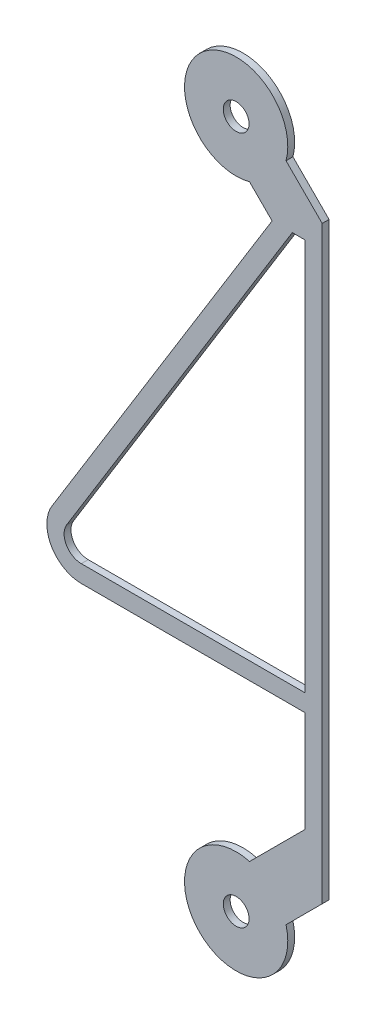
ISO-10303-21;
HEADER;
FILE_DESCRIPTION(('STEP AP214'),'2;1');
FILE_NAME('part.step','',(''),(''),'','','');
FILE_SCHEMA(('AUTOMOTIVE_DESIGN { 1 0 10303 214 1 1 1 1 }'));
ENDSEC;
DATA;
#1=APPLICATION_CONTEXT('core data for automotive mechanical design processes');
#2=APPLICATION_PROTOCOL_DEFINITION('international standard','automotive_design',2000,#1);
#3=PRODUCT_CONTEXT('',#1,'mechanical');
#4=PRODUCT('Part','Part','',(#3));
#5=PRODUCT_RELATED_PRODUCT_CATEGORY('part','',(#4));
#6=PRODUCT_DEFINITION_FORMATION('','',#4);
#7=PRODUCT_DEFINITION_CONTEXT('part definition',#1,'design');
#8=PRODUCT_DEFINITION('design','',#6,#7);
#9=PRODUCT_DEFINITION_SHAPE('','',#8);
#10=(LENGTH_UNIT() NAMED_UNIT(*) SI_UNIT(.MILLI.,.METRE.));
#11=(NAMED_UNIT(*) PLANE_ANGLE_UNIT() SI_UNIT($,.RADIAN.));
#12=(NAMED_UNIT(*) SI_UNIT($,.STERADIAN.) SOLID_ANGLE_UNIT());
#13=UNCERTAINTY_MEASURE_WITH_UNIT(LENGTH_MEASURE(1.E-05),#10,'distance_accuracy_value','');
#14=(GEOMETRIC_REPRESENTATION_CONTEXT(3) GLOBAL_UNCERTAINTY_ASSIGNED_CONTEXT((#13)) GLOBAL_UNIT_ASSIGNED_CONTEXT((#10,
#11,#12)) REPRESENTATION_CONTEXT('',''));
#15=CARTESIAN_POINT('',(0.,0.,0.));
#16=DIRECTION('',(0.,0.,1.));
#17=DIRECTION('',(1.,0.,0.));
#18=AXIS2_PLACEMENT_3D('',#15,#16,#17);
#19=CARTESIAN_POINT('',(0.,-10.,0.1));
#20=DIRECTION('',(0.,0.,1.));
#21=DIRECTION('',(1.,0.,0.));
#22=AXIS2_PLACEMENT_3D('',#19,#20,#21);
#23=PLANE('',#22);
#24=CARTESIAN_POINT('',(0.,10.,0.1));
#25=DIRECTION('',(0.,0.,1.));
#26=DIRECTION('',(1.,0.,0.));
#27=AXIS2_PLACEMENT_3D('',#24,#25,#26);
#28=CIRCLE('',#27,0.375);
#29=CARTESIAN_POINT('',(0.375,10.,0.1));
#30=VERTEX_POINT('',#29);
#31=EDGE_CURVE('E197',#30,#30,#28,.T.);
#32=ORIENTED_EDGE('',*,*,#31,.F.);
#33=EDGE_LOOP('',(#32));
#34=FACE_BOUND('',#33,.T.);
#35=DIRECTION('',(0.,-1.,0.));
#36=VECTOR('',#35,1.);
#37=CARTESIAN_POINT('',(2.,-4.,0.1));
#38=LINE('',#37,#36);
#39=CARTESIAN_POINT('',(2.,-4.,0.1));
#40=VERTEX_POINT('',#39);
#41=CARTESIAN_POINT('',(2.,-6.93933982822024,0.1));
#42=VERTEX_POINT('',#41);
#43=EDGE_CURVE('E203',#40,#42,#38,.T.);
#44=ORIENTED_EDGE('',*,*,#43,.T.);
#45=DIRECTION('',(-0.70710678118655,-0.707106781186545,0.));
#46=VECTOR('',#45,1.);
#47=CARTESIAN_POINT('',(2.,-6.93933982822024,0.1));
#48=LINE('',#47,#46);
#49=CARTESIAN_POINT('',(0.388228567653822,-8.55111126056641,0.1));
#50=VERTEX_POINT('',#49);
#51=EDGE_CURVE('E206',#42,#50,#48,.T.);
#52=ORIENTED_EDGE('',*,*,#51,.T.);
#53=CARTESIAN_POINT('',(0.,-10.,0.1));
#54=DIRECTION('',(0.,0.,1.));
#55=DIRECTION('',(1.,0.,0.));
#56=AXIS2_PLACEMENT_3D('',#53,#54,#55);
#57=CIRCLE('',#56,1.5);
#58=CARTESIAN_POINT('',(1.4488887394336,-9.61177143234619,0.1));
#59=VERTEX_POINT('',#58);
#60=EDGE_CURVE('E209',#50,#59,#57,.T.);
#61=ORIENTED_EDGE('',*,*,#60,.T.);
#62=DIRECTION('',(0.707106781186551,0.707106781186544,0.));
#63=VECTOR('',#62,1.);
#64=CARTESIAN_POINT('',(2.5,-8.5606601717798,0.1));
#65=LINE('',#64,#63);
#66=CARTESIAN_POINT('',(2.5,-8.5606601717798,0.1));
#67=VERTEX_POINT('',#66);
#68=EDGE_CURVE('E211',#59,#67,#65,.T.);
#69=ORIENTED_EDGE('',*,*,#68,.T.);
#70=DIRECTION('',(0.,1.,0.));
#71=VECTOR('',#70,1.);
#72=CARTESIAN_POINT('',(2.5,-8.5606601717798,0.1));
#73=LINE('',#72,#71);
#74=CARTESIAN_POINT('',(2.5,8.5606601717798,0.1));
#75=VERTEX_POINT('',#74);
#76=EDGE_CURVE('E213',#67,#75,#73,.T.);
#77=ORIENTED_EDGE('',*,*,#76,.T.);
#78=DIRECTION('',(-0.707106781186544,0.707106781186551,0.));
#79=VECTOR('',#78,1.);
#80=CARTESIAN_POINT('',(2.5,8.5606601717798,0.1));
#81=LINE('',#80,#79);
#82=CARTESIAN_POINT('',(1.4488887394336,9.61177143234621,0.1));
#83=VERTEX_POINT('',#82);
#84=EDGE_CURVE('E215',#75,#83,#81,.T.);
#85=ORIENTED_EDGE('',*,*,#84,.T.);
#86=CARTESIAN_POINT('',(0.,10.,0.1));
#87=DIRECTION('',(0.,0.,1.));
#88=DIRECTION('',(1.,0.,0.));
#89=AXIS2_PLACEMENT_3D('',#86,#87,#88);
#90=CIRCLE('',#89,1.5);
#91=CARTESIAN_POINT('',(0.388228567653776,8.5511112605664,0.1));
#92=VERTEX_POINT('',#91);
#93=EDGE_CURVE('E217',#83,#92,#90,.T.);
#94=ORIENTED_EDGE('',*,*,#93,.T.);
#95=DIRECTION('',(0.707106781186544,-0.707106781186551,0.));
#96=VECTOR('',#95,1.);
#97=CARTESIAN_POINT('',(1.04409718951556,7.8952426387046,0.1));
#98=LINE('',#97,#96);
#99=CARTESIAN_POINT('',(1.04409718951556,7.8952426387046,0.1));
#100=VERTEX_POINT('',#99);
#101=EDGE_CURVE('E219',#92,#100,#98,.T.);
#102=ORIENTED_EDGE('',*,*,#101,.T.);
#103=DIRECTION('',(-0.524901574807822,-0.851162931972645,0.));
#104=VECTOR('',#103,1.);
#105=CARTESIAN_POINT('',(1.04409718951556,7.8952426387046,0.1));
#106=LINE('',#105,#104);
#107=CARTESIAN_POINT('',(-5.35116293197264,-2.47509842519218,0.1));
#108=VERTEX_POINT('',#107);
#109=EDGE_CURVE('E221',#100,#108,#106,.T.);
#110=ORIENTED_EDGE('',*,*,#109,.T.);
#111=CARTESIAN_POINT('',(-4.5,-3.,0.1));
#112=DIRECTION('',(0.,0.,1.));
#113=DIRECTION('',(1.,0.,0.));
#114=AXIS2_PLACEMENT_3D('',#111,#112,#113);
#115=CIRCLE('',#114,1.);
#116=CARTESIAN_POINT('',(-4.5,-4.,0.1));
#117=VERTEX_POINT('',#116);
#118=EDGE_CURVE('E223',#108,#117,#115,.T.);
#119=ORIENTED_EDGE('',*,*,#118,.T.);
#120=DIRECTION('',(1.,0.,0.));
#121=VECTOR('',#120,1.);
#122=CARTESIAN_POINT('',(-4.5,-4.,0.1));
#123=LINE('',#122,#121);
#124=EDGE_CURVE('E225',#117,#40,#123,.T.);
#125=ORIENTED_EDGE('',*,*,#124,.T.);
#126=EDGE_LOOP('',(#44,#52,#61,#69,#77,#85,#94,#102,#110,#119,#125));
#127=FACE_BOUND('',#126,.T.);
#128=CARTESIAN_POINT('',(0.,-10.,0.1));
#129=DIRECTION('',(0.,0.,1.));
#130=DIRECTION('',(1.,0.,0.));
#131=AXIS2_PLACEMENT_3D('',#128,#129,#130);
#132=CIRCLE('',#131,0.375);
#133=CARTESIAN_POINT('',(0.375000000000006,-10.,0.1));
#134=VERTEX_POINT('',#133);
#135=EDGE_CURVE('E191',#134,#134,#132,.T.);
#136=ORIENTED_EDGE('',*,*,#135,.F.);
#137=EDGE_LOOP('',(#136));
#138=FACE_BOUND('',#137,.T.);
#139=DIRECTION('',(1.,0.,0.));
#140=VECTOR('',#139,1.);
#141=CARTESIAN_POINT('',(-4.5,-3.5,0.1));
#142=LINE('',#141,#140);
#143=CARTESIAN_POINT('',(-4.5,-3.5,0.1));
#144=VERTEX_POINT('',#143);
#145=CARTESIAN_POINT('',(2.,-3.5,0.1));
#146=VERTEX_POINT('',#145);
#147=EDGE_CURVE('E155',#144,#146,#142,.T.);
#148=ORIENTED_EDGE('',*,*,#147,.F.);
#149=CARTESIAN_POINT('',(-4.5,-3.,0.1));
#150=DIRECTION('',(0.,0.,1.));
#151=DIRECTION('',(1.,0.,0.));
#152=AXIS2_PLACEMENT_3D('',#149,#150,#151);
#153=CIRCLE('',#152,0.5);
#154=CARTESIAN_POINT('',(-4.92558146598632,-2.73754921259609,0.1));
#155=VERTEX_POINT('',#154);
#156=EDGE_CURVE('E147',#155,#144,#153,.T.);
#157=ORIENTED_EDGE('',*,*,#156,.F.);
#158=DIRECTION('',(-0.524901574807822,-0.851162931972645,0.));
#159=VECTOR('',#158,1.);
#160=CARTESIAN_POINT('',(1.63152878600345,7.8952426387046,0.1));
#161=LINE('',#160,#159);
#162=CARTESIAN_POINT('',(1.63152878600345,7.8952426387046,0.1));
#163=VERTEX_POINT('',#162);
#164=EDGE_CURVE('E174',#163,#155,#161,.T.);
#165=ORIENTED_EDGE('',*,*,#164,.F.);
#166=DIRECTION('',(-1.,0.,0.));
#167=VECTOR('',#166,1.);
#168=CARTESIAN_POINT('',(1.63152878600345,7.8952426387046,0.1));
#169=LINE('',#168,#167);
#170=CARTESIAN_POINT('',(2.,7.8952426387046,0.1));
#171=VERTEX_POINT('',#170);
#172=EDGE_CURVE('E170',#171,#163,#169,.T.);
#173=ORIENTED_EDGE('',*,*,#172,.F.);
#174=DIRECTION('',(0.,1.,0.));
#175=VECTOR('',#174,1.);
#176=CARTESIAN_POINT('',(2.,-3.5,0.1));
#177=LINE('',#176,#175);
#178=EDGE_CURVE('E168',#146,#171,#177,.T.);
#179=ORIENTED_EDGE('',*,*,#178,.F.);
#180=EDGE_LOOP('',(#148,#157,#165,#173,#179));
#181=FACE_BOUND('',#180,.T.);
#182=ADVANCED_FACE('F34',(#34,#127,#138,#181),#23,.T.);
#183=CARTESIAN_POINT('',(0.,-10.,-0.1));
#184=DIRECTION('',(0.,0.,1.));
#185=DIRECTION('',(1.,0.,0.));
#186=AXIS2_PLACEMENT_3D('',#183,#184,#185);
#187=PLANE('',#186);
#188=CARTESIAN_POINT('',(0.,-10.,-0.1));
#189=DIRECTION('',(0.,0.,1.));
#190=DIRECTION('',(1.,0.,0.));
#191=AXIS2_PLACEMENT_3D('',#188,#189,#190);
#192=CIRCLE('',#191,0.375);
#193=CARTESIAN_POINT('',(0.375000000000006,-10.,-0.1));
#194=VERTEX_POINT('',#193);
#195=EDGE_CURVE('E163',#194,#194,#192,.T.);
#196=ORIENTED_EDGE('',*,*,#195,.T.);
#197=EDGE_LOOP('',(#196));
#198=FACE_BOUND('',#197,.T.);
#199=CARTESIAN_POINT('',(0.,10.,-0.1));
#200=DIRECTION('',(0.,0.,1.));
#201=DIRECTION('',(1.,0.,0.));
#202=AXIS2_PLACEMENT_3D('',#199,#200,#201);
#203=CIRCLE('',#202,0.375);
#204=CARTESIAN_POINT('',(0.375,10.,-0.1));
#205=VERTEX_POINT('',#204);
#206=EDGE_CURVE('E194',#205,#205,#203,.T.);
#207=ORIENTED_EDGE('',*,*,#206,.T.);
#208=EDGE_LOOP('',(#207));
#209=FACE_BOUND('',#208,.T.);
#210=DIRECTION('',(0.,-1.,0.));
#211=VECTOR('',#210,1.);
#212=CARTESIAN_POINT('',(2.,-4.,-0.1));
#213=LINE('',#212,#211);
#214=CARTESIAN_POINT('',(2.,-4.,-0.1));
#215=VERTEX_POINT('',#214);
#216=CARTESIAN_POINT('',(2.,-6.93933982822024,-0.1));
#217=VERTEX_POINT('',#216);
#218=EDGE_CURVE('E200',#215,#217,#213,.T.);
#219=ORIENTED_EDGE('',*,*,#218,.F.);
#220=DIRECTION('',(1.,0.,0.));
#221=VECTOR('',#220,1.);
#222=CARTESIAN_POINT('',(-4.5,-4.,-0.1));
#223=LINE('',#222,#221);
#224=CARTESIAN_POINT('',(-4.5,-4.,-0.1));
#225=VERTEX_POINT('',#224);
#226=EDGE_CURVE('E207',#225,#215,#223,.T.);
#227=ORIENTED_EDGE('',*,*,#226,.F.);
#228=CARTESIAN_POINT('',(-4.5,-3.,-0.1));
#229=DIRECTION('',(0.,0.,1.));
#230=DIRECTION('',(1.,0.,0.));
#231=AXIS2_PLACEMENT_3D('',#228,#229,#230);
#232=CIRCLE('',#231,1.);
#233=CARTESIAN_POINT('',(-5.35116293197264,-2.47509842519218,-0.1));
#234=VERTEX_POINT('',#233);
#235=EDGE_CURVE('E246',#234,#225,#232,.T.);
#236=ORIENTED_EDGE('',*,*,#235,.F.);
#237=DIRECTION('',(-0.524901574807822,-0.851162931972645,0.));
#238=VECTOR('',#237,1.);
#239=CARTESIAN_POINT('',(1.04409718951556,7.8952426387046,-0.1));
#240=LINE('',#239,#238);
#241=CARTESIAN_POINT('',(1.04409718951556,7.8952426387046,-0.1));
#242=VERTEX_POINT('',#241);
#243=EDGE_CURVE('E244',#242,#234,#240,.T.);
#244=ORIENTED_EDGE('',*,*,#243,.F.);
#245=DIRECTION('',(0.707106781186544,-0.707106781186551,0.));
#246=VECTOR('',#245,1.);
#247=CARTESIAN_POINT('',(1.04409718951556,7.8952426387046,-0.1));
#248=LINE('',#247,#246);
#249=CARTESIAN_POINT('',(0.388228567653776,8.5511112605664,-0.1));
#250=VERTEX_POINT('',#249);
#251=EDGE_CURVE('E242',#250,#242,#248,.T.);
#252=ORIENTED_EDGE('',*,*,#251,.F.);
#253=CARTESIAN_POINT('',(0.,10.,-0.1));
#254=DIRECTION('',(0.,0.,1.));
#255=DIRECTION('',(1.,0.,0.));
#256=AXIS2_PLACEMENT_3D('',#253,#254,#255);
#257=CIRCLE('',#256,1.5);
#258=CARTESIAN_POINT('',(1.4488887394336,9.61177143234621,-0.1));
#259=VERTEX_POINT('',#258);
#260=EDGE_CURVE('E240',#259,#250,#257,.T.);
#261=ORIENTED_EDGE('',*,*,#260,.F.);
#262=DIRECTION('',(-0.707106781186544,0.707106781186551,0.));
#263=VECTOR('',#262,1.);
#264=CARTESIAN_POINT('',(2.5,8.5606601717798,-0.1));
#265=LINE('',#264,#263);
#266=CARTESIAN_POINT('',(2.5,8.5606601717798,-0.1));
#267=VERTEX_POINT('',#266);
#268=EDGE_CURVE('E238',#267,#259,#265,.T.);
#269=ORIENTED_EDGE('',*,*,#268,.F.);
#270=DIRECTION('',(0.,1.,0.));
#271=VECTOR('',#270,1.);
#272=CARTESIAN_POINT('',(2.5,-8.5606601717798,-0.1));
#273=LINE('',#272,#271);
#274=CARTESIAN_POINT('',(2.5,-8.5606601717798,-0.1));
#275=VERTEX_POINT('',#274);
#276=EDGE_CURVE('E236',#275,#267,#273,.T.);
#277=ORIENTED_EDGE('',*,*,#276,.F.);
#278=DIRECTION('',(0.707106781186551,0.707106781186544,0.));
#279=VECTOR('',#278,1.);
#280=CARTESIAN_POINT('',(2.5,-8.5606601717798,-0.1));
#281=LINE('',#280,#279);
#282=CARTESIAN_POINT('',(1.4488887394336,-9.61177143234619,-0.1));
#283=VERTEX_POINT('',#282);
#284=EDGE_CURVE('E234',#283,#275,#281,.T.);
#285=ORIENTED_EDGE('',*,*,#284,.F.);
#286=CARTESIAN_POINT('',(0.,-10.,-0.1));
#287=DIRECTION('',(0.,0.,1.));
#288=DIRECTION('',(1.,0.,0.));
#289=AXIS2_PLACEMENT_3D('',#286,#287,#288);
#290=CIRCLE('',#289,1.5);
#291=CARTESIAN_POINT('',(0.388228567653822,-8.55111126056641,-0.1));
#292=VERTEX_POINT('',#291);
#293=EDGE_CURVE('E232',#292,#283,#290,.T.);
#294=ORIENTED_EDGE('',*,*,#293,.F.);
#295=DIRECTION('',(-0.70710678118655,-0.707106781186545,0.));
#296=VECTOR('',#295,1.);
#297=CARTESIAN_POINT('',(2.,-6.93933982822024,-0.1));
#298=LINE('',#297,#296);
#299=EDGE_CURVE('E230',#217,#292,#298,.T.);
#300=ORIENTED_EDGE('',*,*,#299,.F.);
#301=EDGE_LOOP('',(#219,#227,#236,#244,#252,#261,#269,#277,#285,#294,#300));
#302=FACE_BOUND('',#301,.T.);
#303=CARTESIAN_POINT('',(-4.5,-3.,-0.1));
#304=DIRECTION('',(0.,0.,1.));
#305=DIRECTION('',(1.,0.,0.));
#306=AXIS2_PLACEMENT_3D('',#303,#304,#305);
#307=CIRCLE('',#306,0.5);
#308=CARTESIAN_POINT('',(-4.92558146598632,-2.73754921259609,-0.1));
#309=VERTEX_POINT('',#308);
#310=CARTESIAN_POINT('',(-4.5,-3.5,-0.1));
#311=VERTEX_POINT('',#310);
#312=EDGE_CURVE('E57',#309,#311,#307,.T.);
#313=ORIENTED_EDGE('',*,*,#312,.T.);
#314=DIRECTION('',(1.,0.,0.));
#315=VECTOR('',#314,1.);
#316=CARTESIAN_POINT('',(-4.5,-3.5,-0.1));
#317=LINE('',#316,#315);
#318=CARTESIAN_POINT('',(2.,-3.5,-0.1));
#319=VERTEX_POINT('',#318);
#320=EDGE_CURVE('E162',#311,#319,#317,.T.);
#321=ORIENTED_EDGE('',*,*,#320,.T.);
#322=DIRECTION('',(0.,1.,0.));
#323=VECTOR('',#322,1.);
#324=CARTESIAN_POINT('',(2.,-3.5,-0.1));
#325=LINE('',#324,#323);
#326=CARTESIAN_POINT('',(2.,7.8952426387046,-0.1));
#327=VERTEX_POINT('',#326);
#328=EDGE_CURVE('E178',#319,#327,#325,.T.);
#329=ORIENTED_EDGE('',*,*,#328,.T.);
#330=DIRECTION('',(-1.,0.,0.));
#331=VECTOR('',#330,1.);
#332=CARTESIAN_POINT('',(1.63152878600345,7.8952426387046,-0.1));
#333=LINE('',#332,#331);
#334=CARTESIAN_POINT('',(1.63152878600345,7.8952426387046,-0.1));
#335=VERTEX_POINT('',#334);
#336=EDGE_CURVE('E181',#327,#335,#333,.T.);
#337=ORIENTED_EDGE('',*,*,#336,.T.);
#338=DIRECTION('',(-0.524901574807822,-0.851162931972645,0.));
#339=VECTOR('',#338,1.);
#340=CARTESIAN_POINT('',(1.63152878600345,7.8952426387046,-0.1));
#341=LINE('',#340,#339);
#342=EDGE_CURVE('E156',#335,#309,#341,.T.);
#343=ORIENTED_EDGE('',*,*,#342,.T.);
#344=EDGE_LOOP('',(#313,#321,#329,#337,#343));
#345=FACE_BOUND('',#344,.T.);
#346=ADVANCED_FACE('F285',(#198,#209,#302,#345),#187,.F.);
#347=CARTESIAN_POINT('',(2.,-4.,0.1));
#348=DIRECTION('',(1.,0.,0.));
#349=DIRECTION('',(0.,0.,-1.));
#350=AXIS2_PLACEMENT_3D('',#347,#348,#349);
#351=PLANE('',#350);
#352=ORIENTED_EDGE('',*,*,#218,.T.);
#353=DIRECTION('',(0.,0.,-1.));
#354=VECTOR('',#353,1.);
#355=CARTESIAN_POINT('',(2.,-6.93933982822024,0.1));
#356=LINE('',#355,#354);
#357=EDGE_CURVE('E11',#42,#217,#356,.T.);
#358=ORIENTED_EDGE('',*,*,#357,.F.);
#359=ORIENTED_EDGE('',*,*,#43,.F.);
#360=DIRECTION('',(0.,0.,-1.));
#361=VECTOR('',#360,1.);
#362=CARTESIAN_POINT('',(2.,-4.,0.1));
#363=LINE('',#362,#361);
#364=EDGE_CURVE('E227',#40,#215,#363,.T.);
#365=ORIENTED_EDGE('',*,*,#364,.T.);
#366=EDGE_LOOP('',(#352,#358,#359,#365));
#367=FACE_BOUND('',#366,.T.);
#368=ADVANCED_FACE('F36',(#367),#351,.F.);
#369=CARTESIAN_POINT('',(2.,-6.93933982822024,0.1));
#370=DIRECTION('',(0.707106781186545,-0.70710678118655,0.));
#371=DIRECTION('',(0.70710678118655,0.707106781186545,0.));
#372=AXIS2_PLACEMENT_3D('',#369,#370,#371);
#373=PLANE('',#372);
#374=ORIENTED_EDGE('',*,*,#299,.T.);
#375=DIRECTION('',(0.,0.,-1.));
#376=VECTOR('',#375,1.);
#377=CARTESIAN_POINT('',(0.388228567653822,-8.55111126056641,0.1));
#378=LINE('',#377,#376);
#379=EDGE_CURVE('E42',#50,#292,#378,.T.);
#380=ORIENTED_EDGE('',*,*,#379,.F.);
#381=ORIENTED_EDGE('',*,*,#51,.F.);
#382=ORIENTED_EDGE('',*,*,#357,.T.);
#383=EDGE_LOOP('',(#374,#380,#381,#382));
#384=FACE_BOUND('',#383,.T.);
#385=ADVANCED_FACE('F303',(#384),#373,.F.);
#386=CARTESIAN_POINT('',(0.,-10.,0.1));
#387=DIRECTION('',(0.,0.,-1.));
#388=DIRECTION('',(-1.,0.,0.));
#389=AXIS2_PLACEMENT_3D('',#386,#387,#388);
#390=CYLINDRICAL_SURFACE('',#389,1.5);
#391=ORIENTED_EDGE('',*,*,#293,.T.);
#392=DIRECTION('',(0.,0.,-1.));
#393=VECTOR('',#392,1.);
#394=CARTESIAN_POINT('',(1.4488887394336,-9.61177143234619,0.1));
#395=LINE('',#394,#393);
#396=EDGE_CURVE('E272',#59,#283,#395,.T.);
#397=ORIENTED_EDGE('',*,*,#396,.F.);
#398=ORIENTED_EDGE('',*,*,#60,.F.);
#399=ORIENTED_EDGE('',*,*,#379,.T.);
#400=EDGE_LOOP('',(#391,#397,#398,#399));
#401=FACE_BOUND('',#400,.T.);
#402=ADVANCED_FACE('F279',(#401),#390,.T.);
#403=CARTESIAN_POINT('',(2.5,-8.5606601717798,0.1));
#404=DIRECTION('',(-0.707106781186544,0.707106781186551,0.));
#405=DIRECTION('',(-0.707106781186551,-0.707106781186544,0.));
#406=AXIS2_PLACEMENT_3D('',#403,#404,#405);
#407=PLANE('',#406);
#408=ORIENTED_EDGE('',*,*,#284,.T.);
#409=DIRECTION('',(0.,0.,-1.));
#410=VECTOR('',#409,1.);
#411=CARTESIAN_POINT('',(2.5,-8.5606601717798,0.1));
#412=LINE('',#411,#410);
#413=EDGE_CURVE('E269',#67,#275,#412,.T.);
#414=ORIENTED_EDGE('',*,*,#413,.F.);
#415=ORIENTED_EDGE('',*,*,#68,.F.);
#416=ORIENTED_EDGE('',*,*,#396,.T.);
#417=EDGE_LOOP('',(#408,#414,#415,#416));
#418=FACE_BOUND('',#417,.T.);
#419=ADVANCED_FACE('F291',(#418),#407,.F.);
#420=CARTESIAN_POINT('',(2.5,-8.5606601717798,0.1));
#421=DIRECTION('',(-1.,0.,0.));
#422=DIRECTION('',(0.,0.,1.));
#423=AXIS2_PLACEMENT_3D('',#420,#421,#422);
#424=PLANE('',#423);
#425=ORIENTED_EDGE('',*,*,#276,.T.);
#426=DIRECTION('',(0.,0.,-1.));
#427=VECTOR('',#426,1.);
#428=CARTESIAN_POINT('',(2.5,8.5606601717798,0.1));
#429=LINE('',#428,#427);
#430=EDGE_CURVE('E266',#75,#267,#429,.T.);
#431=ORIENTED_EDGE('',*,*,#430,.F.);
#432=ORIENTED_EDGE('',*,*,#76,.F.);
#433=ORIENTED_EDGE('',*,*,#413,.T.);
#434=EDGE_LOOP('',(#425,#431,#432,#433));
#435=FACE_BOUND('',#434,.T.);
#436=ADVANCED_FACE('F295',(#435),#424,.F.);
#437=CARTESIAN_POINT('',(2.5,8.5606601717798,0.1));
#438=DIRECTION('',(-0.707106781186551,-0.707106781186544,0.));
#439=DIRECTION('',(0.707106781186544,-0.707106781186551,0.));
#440=AXIS2_PLACEMENT_3D('',#437,#438,#439);
#441=PLANE('',#440);
#442=ORIENTED_EDGE('',*,*,#268,.T.);
#443=DIRECTION('',(0.,0.,-1.));
#444=VECTOR('',#443,1.);
#445=CARTESIAN_POINT('',(1.4488887394336,9.61177143234621,0.1));
#446=LINE('',#445,#444);
#447=EDGE_CURVE('E263',#83,#259,#446,.T.);
#448=ORIENTED_EDGE('',*,*,#447,.F.);
#449=ORIENTED_EDGE('',*,*,#84,.F.);
#450=ORIENTED_EDGE('',*,*,#430,.T.);
#451=EDGE_LOOP('',(#442,#448,#449,#450));
#452=FACE_BOUND('',#451,.T.);
#453=ADVANCED_FACE('F331',(#452),#441,.F.);
#454=CARTESIAN_POINT('',(0.,10.,0.1));
#455=DIRECTION('',(0.,0.,-1.));
#456=DIRECTION('',(-1.,0.,0.));
#457=AXIS2_PLACEMENT_3D('',#454,#455,#456);
#458=CYLINDRICAL_SURFACE('',#457,1.5);
#459=ORIENTED_EDGE('',*,*,#260,.T.);
#460=DIRECTION('',(0.,0.,-1.));
#461=VECTOR('',#460,1.);
#462=CARTESIAN_POINT('',(0.388228567653776,8.5511112605664,0.1));
#463=LINE('',#462,#461);
#464=EDGE_CURVE('E260',#92,#250,#463,.T.);
#465=ORIENTED_EDGE('',*,*,#464,.F.);
#466=ORIENTED_EDGE('',*,*,#93,.F.);
#467=ORIENTED_EDGE('',*,*,#447,.T.);
#468=EDGE_LOOP('',(#459,#465,#466,#467));
#469=FACE_BOUND('',#468,.T.);
#470=ADVANCED_FACE('F329',(#469),#458,.T.);
#471=CARTESIAN_POINT('',(1.04409718951556,7.8952426387046,0.1));
#472=DIRECTION('',(0.707106781186551,0.707106781186544,0.));
#473=DIRECTION('',(-0.707106781186544,0.707106781186551,0.));
#474=AXIS2_PLACEMENT_3D('',#471,#472,#473);
#475=PLANE('',#474);
#476=ORIENTED_EDGE('',*,*,#251,.T.);
#477=DIRECTION('',(0.,0.,-1.));
#478=VECTOR('',#477,1.);
#479=CARTESIAN_POINT('',(1.04409718951556,7.8952426387046,0.1));
#480=LINE('',#479,#478);
#481=EDGE_CURVE('E257',#100,#242,#480,.T.);
#482=ORIENTED_EDGE('',*,*,#481,.F.);
#483=ORIENTED_EDGE('',*,*,#101,.F.);
#484=ORIENTED_EDGE('',*,*,#464,.T.);
#485=EDGE_LOOP('',(#476,#482,#483,#484));
#486=FACE_BOUND('',#485,.T.);
#487=ADVANCED_FACE('F324',(#486),#475,.F.);
#488=CARTESIAN_POINT('',(1.04409718951556,7.8952426387046,0.1));
#489=DIRECTION('',(0.851162931972645,-0.524901574807821,0.));
#490=DIRECTION('',(0.524901574807822,0.851162931972645,0.));
#491=AXIS2_PLACEMENT_3D('',#488,#489,#490);
#492=PLANE('',#491);
#493=ORIENTED_EDGE('',*,*,#243,.T.);
#494=DIRECTION('',(0.,0.,-1.));
#495=VECTOR('',#494,1.);
#496=CARTESIAN_POINT('',(-5.35116293197264,-2.47509842519218,0.1));
#497=LINE('',#496,#495);
#498=EDGE_CURVE('E254',#108,#234,#497,.T.);
#499=ORIENTED_EDGE('',*,*,#498,.F.);
#500=ORIENTED_EDGE('',*,*,#109,.F.);
#501=ORIENTED_EDGE('',*,*,#481,.T.);
#502=EDGE_LOOP('',(#493,#499,#500,#501));
#503=FACE_BOUND('',#502,.T.);
#504=ADVANCED_FACE('F319',(#503),#492,.F.);
#505=CARTESIAN_POINT('',(-4.5,-3.,0.1));
#506=DIRECTION('',(0.,0.,-1.));
#507=DIRECTION('',(-1.,0.,0.));
#508=AXIS2_PLACEMENT_3D('',#505,#506,#507);
#509=CYLINDRICAL_SURFACE('',#508,1.);
#510=ORIENTED_EDGE('',*,*,#235,.T.);
#511=DIRECTION('',(0.,0.,-1.));
#512=VECTOR('',#511,1.);
#513=CARTESIAN_POINT('',(-4.5,-4.,0.1));
#514=LINE('',#513,#512);
#515=EDGE_CURVE('E251',#117,#225,#514,.T.);
#516=ORIENTED_EDGE('',*,*,#515,.F.);
#517=ORIENTED_EDGE('',*,*,#118,.F.);
#518=ORIENTED_EDGE('',*,*,#498,.T.);
#519=EDGE_LOOP('',(#510,#516,#517,#518));
#520=FACE_BOUND('',#519,.T.);
#521=ADVANCED_FACE('F315',(#520),#509,.T.);
#522=CARTESIAN_POINT('',(-4.5,-4.,0.1));
#523=DIRECTION('',(0.,1.,0.));
#524=DIRECTION('',(0.,0.,1.));
#525=AXIS2_PLACEMENT_3D('',#522,#523,#524);
#526=PLANE('',#525);
#527=ORIENTED_EDGE('',*,*,#226,.T.);
#528=ORIENTED_EDGE('',*,*,#364,.F.);
#529=ORIENTED_EDGE('',*,*,#124,.F.);
#530=ORIENTED_EDGE('',*,*,#515,.T.);
#531=EDGE_LOOP('',(#527,#528,#529,#530));
#532=FACE_BOUND('',#531,.T.);
#533=ADVANCED_FACE('F310',(#532),#526,.F.);
#534=CARTESIAN_POINT('',(0.,10.,0.1));
#535=DIRECTION('',(0.,0.,-1.));
#536=DIRECTION('',(-1.,0.,0.));
#537=AXIS2_PLACEMENT_3D('',#534,#535,#536);
#538=CYLINDRICAL_SURFACE('',#537,0.375);
#539=ORIENTED_EDGE('',*,*,#31,.T.);
#540=EDGE_LOOP('',(#539));
#541=FACE_BOUND('',#540,.T.);
#542=ORIENTED_EDGE('',*,*,#206,.F.);
#543=EDGE_LOOP('',(#542));
#544=FACE_BOUND('',#543,.T.);
#545=ADVANCED_FACE('F350',(#541,#544),#538,.F.);
#546=CARTESIAN_POINT('',(0.,-10.,0.1));
#547=DIRECTION('',(0.,0.,-1.));
#548=DIRECTION('',(-1.,0.,0.));
#549=AXIS2_PLACEMENT_3D('',#546,#547,#548);
#550=CYLINDRICAL_SURFACE('',#549,0.375);
#551=ORIENTED_EDGE('',*,*,#135,.T.);
#552=EDGE_LOOP('',(#551));
#553=FACE_BOUND('',#552,.T.);
#554=ORIENTED_EDGE('',*,*,#195,.F.);
#555=EDGE_LOOP('',(#554));
#556=FACE_BOUND('',#555,.T.);
#557=ADVANCED_FACE('F382',(#553,#556),#550,.F.);
#558=CARTESIAN_POINT('',(-4.5,-3.,0.1));
#559=DIRECTION('',(0.,0.,-1.));
#560=DIRECTION('',(-1.,0.,0.));
#561=AXIS2_PLACEMENT_3D('',#558,#559,#560);
#562=CYLINDRICAL_SURFACE('',#561,0.5);
#563=ORIENTED_EDGE('',*,*,#312,.F.);
#564=DIRECTION('',(0.,0.,-1.));
#565=VECTOR('',#564,1.);
#566=CARTESIAN_POINT('',(-4.92558146598632,-2.73754921259609,0.1));
#567=LINE('',#566,#565);
#568=EDGE_CURVE('E151',#155,#309,#567,.T.);
#569=ORIENTED_EDGE('',*,*,#568,.F.);
#570=ORIENTED_EDGE('',*,*,#156,.T.);
#571=DIRECTION('',(0.,0.,-1.));
#572=VECTOR('',#571,1.);
#573=CARTESIAN_POINT('',(-4.5,-3.5,0.1));
#574=LINE('',#573,#572);
#575=EDGE_CURVE('E150',#144,#311,#574,.T.);
#576=ORIENTED_EDGE('',*,*,#575,.T.);
#577=EDGE_LOOP('',(#563,#569,#570,#576));
#578=FACE_BOUND('',#577,.T.);
#579=ADVANCED_FACE('F149',(#578),#562,.F.);
#580=CARTESIAN_POINT('',(-4.5,-3.5,0.1));
#581=DIRECTION('',(0.,1.,0.));
#582=DIRECTION('',(0.,0.,1.));
#583=AXIS2_PLACEMENT_3D('',#580,#581,#582);
#584=PLANE('',#583);
#585=ORIENTED_EDGE('',*,*,#320,.F.);
#586=ORIENTED_EDGE('',*,*,#575,.F.);
#587=ORIENTED_EDGE('',*,*,#147,.T.);
#588=DIRECTION('',(0.,0.,-1.));
#589=VECTOR('',#588,1.);
#590=CARTESIAN_POINT('',(2.,-3.5,0.1));
#591=LINE('',#590,#589);
#592=EDGE_CURVE('E164',#146,#319,#591,.T.);
#593=ORIENTED_EDGE('',*,*,#592,.T.);
#594=EDGE_LOOP('',(#585,#586,#587,#593));
#595=FACE_BOUND('',#594,.T.);
#596=ADVANCED_FACE('F159',(#595),#584,.T.);
#597=CARTESIAN_POINT('',(2.,-3.5,0.1));
#598=DIRECTION('',(-1.,0.,0.));
#599=DIRECTION('',(0.,-1.,0.));
#600=AXIS2_PLACEMENT_3D('',#597,#598,#599);
#601=PLANE('',#600);
#602=ORIENTED_EDGE('',*,*,#328,.F.);
#603=ORIENTED_EDGE('',*,*,#592,.F.);
#604=ORIENTED_EDGE('',*,*,#178,.T.);
#605=DIRECTION('',(0.,0.,-1.));
#606=VECTOR('',#605,1.);
#607=CARTESIAN_POINT('',(2.,7.8952426387046,0.1));
#608=LINE('',#607,#606);
#609=EDGE_CURVE('E188',#171,#327,#608,.T.);
#610=ORIENTED_EDGE('',*,*,#609,.T.);
#611=EDGE_LOOP('',(#602,#603,#604,#610));
#612=FACE_BOUND('',#611,.T.);
#613=ADVANCED_FACE('F401',(#612),#601,.T.);
#614=CARTESIAN_POINT('',(1.63152878600345,7.8952426387046,0.1));
#615=DIRECTION('',(0.,-1.,0.));
#616=DIRECTION('',(0.,0.,-1.));
#617=AXIS2_PLACEMENT_3D('',#614,#615,#616);
#618=PLANE('',#617);
#619=ORIENTED_EDGE('',*,*,#336,.F.);
#620=ORIENTED_EDGE('',*,*,#609,.F.);
#621=ORIENTED_EDGE('',*,*,#172,.T.);
#622=DIRECTION('',(0.,0.,-1.));
#623=VECTOR('',#622,1.);
#624=CARTESIAN_POINT('',(1.63152878600345,7.8952426387046,0.1));
#625=LINE('',#624,#623);
#626=EDGE_CURVE('E49',#163,#335,#625,.T.);
#627=ORIENTED_EDGE('',*,*,#626,.T.);
#628=EDGE_LOOP('',(#619,#620,#621,#627));
#629=FACE_BOUND('',#628,.T.);
#630=ADVANCED_FACE('F408',(#629),#618,.T.);
#631=CARTESIAN_POINT('',(1.63152878600345,7.8952426387046,0.1));
#632=DIRECTION('',(0.851162931972645,-0.524901574807821,0.));
#633=DIRECTION('',(0.524901574807821,0.851162931972645,0.));
#634=AXIS2_PLACEMENT_3D('',#631,#632,#633);
#635=PLANE('',#634);
#636=ORIENTED_EDGE('',*,*,#342,.F.);
#637=ORIENTED_EDGE('',*,*,#626,.F.);
#638=ORIENTED_EDGE('',*,*,#164,.T.);
#639=ORIENTED_EDGE('',*,*,#568,.T.);
#640=EDGE_LOOP('',(#636,#637,#638,#639));
#641=FACE_BOUND('',#640,.T.);
#642=ADVANCED_FACE('F416',(#641),#635,.T.);
#643=CLOSED_SHELL('',(#182,#346,#368,#385,#402,#419,#436,#453,#470,#487,#504,#521,#533,#545,
#557,#579,#596,#613,#630,#642));
#644=MANIFOLD_SOLID_BREP('B2',#643);
#645=ADVANCED_BREP_SHAPE_REPRESENTATION('',(#18,#644),#14);
#646=SHAPE_DEFINITION_REPRESENTATION(#9,#645);
ENDSEC;
END-ISO-10303-21;
